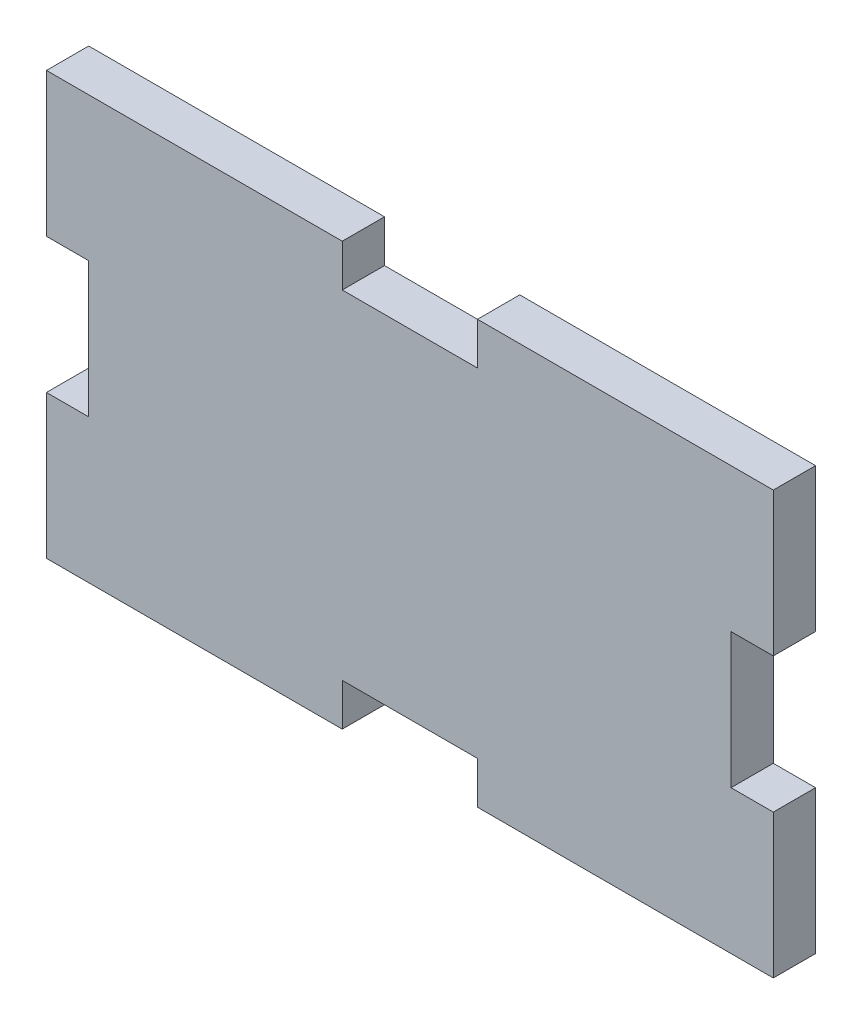
ISO-10303-21;
HEADER;
FILE_DESCRIPTION(('STEP AP214'),'2;1');
FILE_NAME('part.step','',(''),(''),'','','');
FILE_SCHEMA(('AUTOMOTIVE_DESIGN { 1 0 10303 214 1 1 1 1 }'));
ENDSEC;
DATA;
#1=APPLICATION_CONTEXT('core data for automotive mechanical design processes');
#2=APPLICATION_PROTOCOL_DEFINITION('international standard','automotive_design',2000,#1);
#3=PRODUCT_CONTEXT('',#1,'mechanical');
#4=PRODUCT('Part','Part','',(#3));
#5=PRODUCT_RELATED_PRODUCT_CATEGORY('part','',(#4));
#6=PRODUCT_DEFINITION_FORMATION('','',#4);
#7=PRODUCT_DEFINITION_CONTEXT('part definition',#1,'design');
#8=PRODUCT_DEFINITION('design','',#6,#7);
#9=PRODUCT_DEFINITION_SHAPE('','',#8);
#10=(LENGTH_UNIT() NAMED_UNIT(*) SI_UNIT(.MILLI.,.METRE.));
#11=(NAMED_UNIT(*) PLANE_ANGLE_UNIT() SI_UNIT($,.RADIAN.));
#12=(NAMED_UNIT(*) SI_UNIT($,.STERADIAN.) SOLID_ANGLE_UNIT());
#13=UNCERTAINTY_MEASURE_WITH_UNIT(LENGTH_MEASURE(1.E-05),#10,'distance_accuracy_value','');
#14=(GEOMETRIC_REPRESENTATION_CONTEXT(3) GLOBAL_UNCERTAINTY_ASSIGNED_CONTEXT((#13)) GLOBAL_UNIT_ASSIGNED_CONTEXT((#10,
#11,#12)) REPRESENTATION_CONTEXT('',''));
#15=CARTESIAN_POINT('',(0.,0.,0.));
#16=DIRECTION('',(0.,0.,1.));
#17=DIRECTION('',(1.,0.,0.));
#18=AXIS2_PLACEMENT_3D('',#15,#16,#17);
#19=CARTESIAN_POINT('',(8.,-25.,5.));
#20=DIRECTION('',(0.,1.,0.));
#21=DIRECTION('',(0.,0.,1.));
#22=AXIS2_PLACEMENT_3D('',#19,#20,#21);
#23=PLANE('',#22);
#24=DIRECTION('',(1.,0.,0.));
#25=VECTOR('',#24,1.);
#26=CARTESIAN_POINT('',(8.,-25.,0.));
#27=LINE('',#26,#25);
#28=CARTESIAN_POINT('',(8.,-25.,0.));
#29=VERTEX_POINT('',#28);
#30=CARTESIAN_POINT('',(43.,-25.,0.));
#31=VERTEX_POINT('',#30);
#32=EDGE_CURVE('E214',#29,#31,#27,.T.);
#33=ORIENTED_EDGE('',*,*,#32,.T.);
#34=DIRECTION('',(0.,0.,-1.));
#35=VECTOR('',#34,1.);
#36=CARTESIAN_POINT('',(43.,-25.,5.));
#37=LINE('',#36,#35);
#38=CARTESIAN_POINT('',(43.,-25.,5.));
#39=VERTEX_POINT('',#38);
#40=EDGE_CURVE('E11',#39,#31,#37,.T.);
#41=ORIENTED_EDGE('',*,*,#40,.F.);
#42=DIRECTION('',(1.,0.,0.));
#43=VECTOR('',#42,1.);
#44=CARTESIAN_POINT('',(8.,-25.,5.));
#45=LINE('',#44,#43);
#46=CARTESIAN_POINT('',(8.,-25.,5.));
#47=VERTEX_POINT('',#46);
#48=EDGE_CURVE('E272',#47,#39,#45,.T.);
#49=ORIENTED_EDGE('',*,*,#48,.F.);
#50=DIRECTION('',(0.,0.,-1.));
#51=VECTOR('',#50,1.);
#52=CARTESIAN_POINT('',(8.,-25.,5.));
#53=LINE('',#52,#51);
#54=EDGE_CURVE('E210',#47,#29,#53,.T.);
#55=ORIENTED_EDGE('',*,*,#54,.T.);
#56=EDGE_LOOP('',(#33,#41,#49,#55));
#57=FACE_BOUND('',#56,.T.);
#58=ADVANCED_FACE('F41',(#57),#23,.F.);
#59=CARTESIAN_POINT('',(43.,-8.,5.));
#60=DIRECTION('',(-1.,0.,0.));
#61=DIRECTION('',(0.,0.,1.));
#62=AXIS2_PLACEMENT_3D('',#59,#60,#61);
#63=PLANE('',#62);
#64=DIRECTION('',(0.,1.,0.));
#65=VECTOR('',#64,1.);
#66=CARTESIAN_POINT('',(43.,-8.,0.));
#67=LINE('',#66,#65);
#68=CARTESIAN_POINT('',(43.,-8.,0.));
#69=VERTEX_POINT('',#68);
#70=EDGE_CURVE('E218',#31,#69,#67,.T.);
#71=ORIENTED_EDGE('',*,*,#70,.T.);
#72=DIRECTION('',(0.,0.,-1.));
#73=VECTOR('',#72,1.);
#74=CARTESIAN_POINT('',(43.,-8.,5.));
#75=LINE('',#74,#73);
#76=CARTESIAN_POINT('',(43.,-8.,5.));
#77=VERTEX_POINT('',#76);
#78=EDGE_CURVE('E50',#77,#69,#75,.T.);
#79=ORIENTED_EDGE('',*,*,#78,.F.);
#80=DIRECTION('',(0.,1.,0.));
#81=VECTOR('',#80,1.);
#82=CARTESIAN_POINT('',(43.,-8.,5.));
#83=LINE('',#82,#81);
#84=EDGE_CURVE('E137',#39,#77,#83,.T.);
#85=ORIENTED_EDGE('',*,*,#84,.F.);
#86=ORIENTED_EDGE('',*,*,#40,.T.);
#87=EDGE_LOOP('',(#71,#79,#85,#86));
#88=FACE_BOUND('',#87,.T.);
#89=ADVANCED_FACE('F422',(#88),#63,.F.);
#90=CARTESIAN_POINT('',(38.,-8.,5.));
#91=DIRECTION('',(0.,-1.,0.));
#92=DIRECTION('',(1.,0.,0.));
#93=AXIS2_PLACEMENT_3D('',#90,#91,#92);
#94=PLANE('',#93);
#95=DIRECTION('',(-1.,0.,0.));
#96=VECTOR('',#95,1.);
#97=CARTESIAN_POINT('',(38.,-8.,0.));
#98=LINE('',#97,#96);
#99=CARTESIAN_POINT('',(38.,-8.,0.));
#100=VERTEX_POINT('',#99);
#101=EDGE_CURVE('E221',#69,#100,#98,.T.);
#102=ORIENTED_EDGE('',*,*,#101,.T.);
#103=DIRECTION('',(0.,0.,-1.));
#104=VECTOR('',#103,1.);
#105=CARTESIAN_POINT('',(38.,-8.,5.));
#106=LINE('',#105,#104);
#107=CARTESIAN_POINT('',(38.,-8.,5.));
#108=VERTEX_POINT('',#107);
#109=EDGE_CURVE('E331',#108,#100,#106,.T.);
#110=ORIENTED_EDGE('',*,*,#109,.F.);
#111=DIRECTION('',(-1.,0.,0.));
#112=VECTOR('',#111,1.);
#113=CARTESIAN_POINT('',(38.,-8.,5.));
#114=LINE('',#113,#112);
#115=EDGE_CURVE('E341',#77,#108,#114,.T.);
#116=ORIENTED_EDGE('',*,*,#115,.F.);
#117=ORIENTED_EDGE('',*,*,#78,.T.);
#118=EDGE_LOOP('',(#102,#110,#116,#117));
#119=FACE_BOUND('',#118,.T.);
#120=ADVANCED_FACE('F339',(#119),#94,.F.);
#121=CARTESIAN_POINT('',(38.,8.,5.));
#122=DIRECTION('',(-1.,0.,0.));
#123=DIRECTION('',(0.,0.,1.));
#124=AXIS2_PLACEMENT_3D('',#121,#122,#123);
#125=PLANE('',#124);
#126=DIRECTION('',(0.,1.,0.));
#127=VECTOR('',#126,1.);
#128=CARTESIAN_POINT('',(38.,8.,0.));
#129=LINE('',#128,#127);
#130=CARTESIAN_POINT('',(38.,8.,0.));
#131=VERTEX_POINT('',#130);
#132=EDGE_CURVE('E224',#100,#131,#129,.T.);
#133=ORIENTED_EDGE('',*,*,#132,.T.);
#134=DIRECTION('',(0.,0.,-1.));
#135=VECTOR('',#134,1.);
#136=CARTESIAN_POINT('',(38.,8.,5.));
#137=LINE('',#136,#135);
#138=CARTESIAN_POINT('',(38.,8.,5.));
#139=VERTEX_POINT('',#138);
#140=EDGE_CURVE('E327',#139,#131,#137,.T.);
#141=ORIENTED_EDGE('',*,*,#140,.F.);
#142=DIRECTION('',(0.,1.,0.));
#143=VECTOR('',#142,1.);
#144=CARTESIAN_POINT('',(38.,8.,5.));
#145=LINE('',#144,#143);
#146=EDGE_CURVE('E360',#108,#139,#145,.T.);
#147=ORIENTED_EDGE('',*,*,#146,.F.);
#148=ORIENTED_EDGE('',*,*,#109,.T.);
#149=EDGE_LOOP('',(#133,#141,#147,#148));
#150=FACE_BOUND('',#149,.T.);
#151=ADVANCED_FACE('F350',(#150),#125,.F.);
#152=CARTESIAN_POINT('',(43.,8.,5.));
#153=DIRECTION('',(0.,1.,0.));
#154=DIRECTION('',(-1.,0.,0.));
#155=AXIS2_PLACEMENT_3D('',#152,#153,#154);
#156=PLANE('',#155);
#157=DIRECTION('',(1.,0.,0.));
#158=VECTOR('',#157,1.);
#159=CARTESIAN_POINT('',(43.,8.,0.));
#160=LINE('',#159,#158);
#161=CARTESIAN_POINT('',(43.,8.,0.));
#162=VERTEX_POINT('',#161);
#163=EDGE_CURVE('E227',#131,#162,#160,.T.);
#164=ORIENTED_EDGE('',*,*,#163,.T.);
#165=DIRECTION('',(0.,0.,-1.));
#166=VECTOR('',#165,1.);
#167=CARTESIAN_POINT('',(43.,8.,5.));
#168=LINE('',#167,#166);
#169=CARTESIAN_POINT('',(43.,8.,5.));
#170=VERTEX_POINT('',#169);
#171=EDGE_CURVE('E323',#170,#162,#168,.T.);
#172=ORIENTED_EDGE('',*,*,#171,.F.);
#173=DIRECTION('',(1.,0.,0.));
#174=VECTOR('',#173,1.);
#175=CARTESIAN_POINT('',(43.,8.,5.));
#176=LINE('',#175,#174);
#177=EDGE_CURVE('E356',#139,#170,#176,.T.);
#178=ORIENTED_EDGE('',*,*,#177,.F.);
#179=ORIENTED_EDGE('',*,*,#140,.T.);
#180=EDGE_LOOP('',(#164,#172,#178,#179));
#181=FACE_BOUND('',#180,.T.);
#182=ADVANCED_FACE('F354',(#181),#156,.F.);
#183=CARTESIAN_POINT('',(43.,25.,5.));
#184=DIRECTION('',(-1.,0.,0.));
#185=DIRECTION('',(0.,-1.,0.));
#186=AXIS2_PLACEMENT_3D('',#183,#184,#185);
#187=PLANE('',#186);
#188=DIRECTION('',(0.,1.,0.));
#189=VECTOR('',#188,1.);
#190=CARTESIAN_POINT('',(43.,25.,0.));
#191=LINE('',#190,#189);
#192=CARTESIAN_POINT('',(43.,25.,0.));
#193=VERTEX_POINT('',#192);
#194=EDGE_CURVE('E230',#162,#193,#191,.T.);
#195=ORIENTED_EDGE('',*,*,#194,.T.);
#196=DIRECTION('',(0.,0.,-1.));
#197=VECTOR('',#196,1.);
#198=CARTESIAN_POINT('',(43.,25.,5.));
#199=LINE('',#198,#197);
#200=CARTESIAN_POINT('',(43.,25.,5.));
#201=VERTEX_POINT('',#200);
#202=EDGE_CURVE('E319',#201,#193,#199,.T.);
#203=ORIENTED_EDGE('',*,*,#202,.F.);
#204=DIRECTION('',(0.,1.,0.));
#205=VECTOR('',#204,1.);
#206=CARTESIAN_POINT('',(43.,25.,5.));
#207=LINE('',#206,#205);
#208=EDGE_CURVE('E359',#170,#201,#207,.T.);
#209=ORIENTED_EDGE('',*,*,#208,.F.);
#210=ORIENTED_EDGE('',*,*,#171,.T.);
#211=EDGE_LOOP('',(#195,#203,#209,#210));
#212=FACE_BOUND('',#211,.T.);
#213=ADVANCED_FACE('F435',(#212),#187,.F.);
#214=CARTESIAN_POINT('',(7.99999999999999,25.,5.));
#215=DIRECTION('',(0.,-1.,0.));
#216=DIRECTION('',(0.,0.,-1.));
#217=AXIS2_PLACEMENT_3D('',#214,#215,#216);
#218=PLANE('',#217);
#219=DIRECTION('',(-1.,0.,0.));
#220=VECTOR('',#219,1.);
#221=CARTESIAN_POINT('',(7.99999999999999,25.,0.));
#222=LINE('',#221,#220);
#223=CARTESIAN_POINT('',(7.99999999999999,25.,0.));
#224=VERTEX_POINT('',#223);
#225=EDGE_CURVE('E233',#193,#224,#222,.T.);
#226=ORIENTED_EDGE('',*,*,#225,.T.);
#227=DIRECTION('',(0.,0.,-1.));
#228=VECTOR('',#227,1.);
#229=CARTESIAN_POINT('',(7.99999999999999,25.,5.));
#230=LINE('',#229,#228);
#231=CARTESIAN_POINT('',(7.99999999999999,25.,5.));
#232=VERTEX_POINT('',#231);
#233=EDGE_CURVE('E315',#232,#224,#230,.T.);
#234=ORIENTED_EDGE('',*,*,#233,.F.);
#235=DIRECTION('',(-1.,0.,0.));
#236=VECTOR('',#235,1.);
#237=CARTESIAN_POINT('',(7.99999999999999,25.,5.));
#238=LINE('',#237,#236);
#239=EDGE_CURVE('E364',#201,#232,#238,.T.);
#240=ORIENTED_EDGE('',*,*,#239,.F.);
#241=ORIENTED_EDGE('',*,*,#202,.T.);
#242=EDGE_LOOP('',(#226,#234,#240,#241));
#243=FACE_BOUND('',#242,.T.);
#244=ADVANCED_FACE('F438',(#243),#218,.F.);
#245=CARTESIAN_POINT('',(7.99999999999999,20.,5.));
#246=DIRECTION('',(1.,0.,0.));
#247=DIRECTION('',(0.,0.,-1.));
#248=AXIS2_PLACEMENT_3D('',#245,#246,#247);
#249=PLANE('',#248);
#250=DIRECTION('',(0.,-1.,0.));
#251=VECTOR('',#250,1.);
#252=CARTESIAN_POINT('',(7.99999999999999,20.,0.));
#253=LINE('',#252,#251);
#254=CARTESIAN_POINT('',(7.99999999999999,20.,0.));
#255=VERTEX_POINT('',#254);
#256=EDGE_CURVE('E236',#224,#255,#253,.T.);
#257=ORIENTED_EDGE('',*,*,#256,.T.);
#258=DIRECTION('',(0.,0.,-1.));
#259=VECTOR('',#258,1.);
#260=CARTESIAN_POINT('',(7.99999999999999,20.,5.));
#261=LINE('',#260,#259);
#262=CARTESIAN_POINT('',(7.99999999999999,20.,5.));
#263=VERTEX_POINT('',#262);
#264=EDGE_CURVE('E311',#263,#255,#261,.T.);
#265=ORIENTED_EDGE('',*,*,#264,.F.);
#266=DIRECTION('',(0.,-1.,0.));
#267=VECTOR('',#266,1.);
#268=CARTESIAN_POINT('',(7.99999999999999,20.,5.));
#269=LINE('',#268,#267);
#270=EDGE_CURVE('E371',#232,#263,#269,.T.);
#271=ORIENTED_EDGE('',*,*,#270,.F.);
#272=ORIENTED_EDGE('',*,*,#233,.T.);
#273=EDGE_LOOP('',(#257,#265,#271,#272));
#274=FACE_BOUND('',#273,.T.);
#275=ADVANCED_FACE('F442',(#274),#249,.F.);
#276=CARTESIAN_POINT('',(-8.00000000000001,20.,5.));
#277=DIRECTION('',(0.,-1.,0.));
#278=DIRECTION('',(0.,0.,-1.));
#279=AXIS2_PLACEMENT_3D('',#276,#277,#278);
#280=PLANE('',#279);
#281=DIRECTION('',(-1.,0.,0.));
#282=VECTOR('',#281,1.);
#283=CARTESIAN_POINT('',(-8.00000000000001,20.,0.));
#284=LINE('',#283,#282);
#285=CARTESIAN_POINT('',(-8.00000000000001,20.,0.));
#286=VERTEX_POINT('',#285);
#287=EDGE_CURVE('E239',#255,#286,#284,.T.);
#288=ORIENTED_EDGE('',*,*,#287,.T.);
#289=DIRECTION('',(0.,0.,-1.));
#290=VECTOR('',#289,1.);
#291=CARTESIAN_POINT('',(-8.00000000000001,20.,5.));
#292=LINE('',#291,#290);
#293=CARTESIAN_POINT('',(-8.00000000000001,20.,5.));
#294=VERTEX_POINT('',#293);
#295=EDGE_CURVE('E307',#294,#286,#292,.T.);
#296=ORIENTED_EDGE('',*,*,#295,.F.);
#297=DIRECTION('',(-1.,0.,0.));
#298=VECTOR('',#297,1.);
#299=CARTESIAN_POINT('',(-8.00000000000001,20.,5.));
#300=LINE('',#299,#298);
#301=EDGE_CURVE('E374',#263,#294,#300,.T.);
#302=ORIENTED_EDGE('',*,*,#301,.F.);
#303=ORIENTED_EDGE('',*,*,#264,.T.);
#304=EDGE_LOOP('',(#288,#296,#302,#303));
#305=FACE_BOUND('',#304,.T.);
#306=ADVANCED_FACE('F446',(#305),#280,.F.);
#307=CARTESIAN_POINT('',(-7.99999999999999,25.,5.));
#308=DIRECTION('',(-1.,0.,0.));
#309=DIRECTION('',(0.,-1.,0.));
#310=AXIS2_PLACEMENT_3D('',#307,#308,#309);
#311=PLANE('',#310);
#312=DIRECTION('',(0.,1.,0.));
#313=VECTOR('',#312,1.);
#314=CARTESIAN_POINT('',(-7.99999999999999,25.,0.));
#315=LINE('',#314,#313);
#316=CARTESIAN_POINT('',(-7.99999999999999,25.,0.));
#317=VERTEX_POINT('',#316);
#318=EDGE_CURVE('E242',#286,#317,#315,.T.);
#319=ORIENTED_EDGE('',*,*,#318,.T.);
#320=DIRECTION('',(0.,0.,-1.));
#321=VECTOR('',#320,1.);
#322=CARTESIAN_POINT('',(-7.99999999999999,25.,5.));
#323=LINE('',#322,#321);
#324=CARTESIAN_POINT('',(-7.99999999999999,25.,5.));
#325=VERTEX_POINT('',#324);
#326=EDGE_CURVE('E303',#325,#317,#323,.T.);
#327=ORIENTED_EDGE('',*,*,#326,.F.);
#328=DIRECTION('',(0.,1.,0.));
#329=VECTOR('',#328,1.);
#330=CARTESIAN_POINT('',(-7.99999999999999,25.,5.));
#331=LINE('',#330,#329);
#332=EDGE_CURVE('E377',#294,#325,#331,.T.);
#333=ORIENTED_EDGE('',*,*,#332,.F.);
#334=ORIENTED_EDGE('',*,*,#295,.T.);
#335=EDGE_LOOP('',(#319,#327,#333,#334));
#336=FACE_BOUND('',#335,.T.);
#337=ADVANCED_FACE('F450',(#336),#311,.F.);
#338=CARTESIAN_POINT('',(-43.,25.,5.));
#339=DIRECTION('',(0.,-1.,0.));
#340=DIRECTION('',(1.,0.,0.));
#341=AXIS2_PLACEMENT_3D('',#338,#339,#340);
#342=PLANE('',#341);
#343=DIRECTION('',(-1.,0.,0.));
#344=VECTOR('',#343,1.);
#345=CARTESIAN_POINT('',(-43.,25.,0.));
#346=LINE('',#345,#344);
#347=CARTESIAN_POINT('',(-43.,25.,0.));
#348=VERTEX_POINT('',#347);
#349=EDGE_CURVE('E245',#317,#348,#346,.T.);
#350=ORIENTED_EDGE('',*,*,#349,.T.);
#351=DIRECTION('',(0.,0.,-1.));
#352=VECTOR('',#351,1.);
#353=CARTESIAN_POINT('',(-43.,25.,5.));
#354=LINE('',#353,#352);
#355=CARTESIAN_POINT('',(-43.,25.,5.));
#356=VERTEX_POINT('',#355);
#357=EDGE_CURVE('E299',#356,#348,#354,.T.);
#358=ORIENTED_EDGE('',*,*,#357,.F.);
#359=DIRECTION('',(-1.,0.,0.));
#360=VECTOR('',#359,1.);
#361=CARTESIAN_POINT('',(-43.,25.,5.));
#362=LINE('',#361,#360);
#363=EDGE_CURVE('E380',#325,#356,#362,.T.);
#364=ORIENTED_EDGE('',*,*,#363,.F.);
#365=ORIENTED_EDGE('',*,*,#326,.T.);
#366=EDGE_LOOP('',(#350,#358,#364,#365));
#367=FACE_BOUND('',#366,.T.);
#368=ADVANCED_FACE('F454',(#367),#342,.F.);
#369=CARTESIAN_POINT('',(-43.,25.,5.));
#370=DIRECTION('',(1.,0.,0.));
#371=DIRECTION('',(0.,1.,0.));
#372=AXIS2_PLACEMENT_3D('',#369,#370,#371);
#373=PLANE('',#372);
#374=DIRECTION('',(0.,-1.,0.));
#375=VECTOR('',#374,1.);
#376=CARTESIAN_POINT('',(-43.,25.,0.));
#377=LINE('',#376,#375);
#378=CARTESIAN_POINT('',(-43.,8.,0.));
#379=VERTEX_POINT('',#378);
#380=EDGE_CURVE('E248',#348,#379,#377,.T.);
#381=ORIENTED_EDGE('',*,*,#380,.T.);
#382=DIRECTION('',(0.,0.,-1.));
#383=VECTOR('',#382,1.);
#384=CARTESIAN_POINT('',(-43.,8.,5.));
#385=LINE('',#384,#383);
#386=CARTESIAN_POINT('',(-43.,8.,5.));
#387=VERTEX_POINT('',#386);
#388=EDGE_CURVE('E295',#387,#379,#385,.T.);
#389=ORIENTED_EDGE('',*,*,#388,.F.);
#390=DIRECTION('',(0.,-1.,0.));
#391=VECTOR('',#390,1.);
#392=CARTESIAN_POINT('',(-43.,25.,5.));
#393=LINE('',#392,#391);
#394=EDGE_CURVE('E383',#356,#387,#393,.T.);
#395=ORIENTED_EDGE('',*,*,#394,.F.);
#396=ORIENTED_EDGE('',*,*,#357,.T.);
#397=EDGE_LOOP('',(#381,#389,#395,#396));
#398=FACE_BOUND('',#397,.T.);
#399=ADVANCED_FACE('F458',(#398),#373,.F.);
#400=CARTESIAN_POINT('',(-43.,8.,5.));
#401=DIRECTION('',(0.,1.,0.));
#402=DIRECTION('',(0.,0.,1.));
#403=AXIS2_PLACEMENT_3D('',#400,#401,#402);
#404=PLANE('',#403);
#405=DIRECTION('',(1.,0.,0.));
#406=VECTOR('',#405,1.);
#407=CARTESIAN_POINT('',(-43.,8.,0.));
#408=LINE('',#407,#406);
#409=CARTESIAN_POINT('',(-38.,8.,0.));
#410=VERTEX_POINT('',#409);
#411=EDGE_CURVE('E251',#379,#410,#408,.T.);
#412=ORIENTED_EDGE('',*,*,#411,.T.);
#413=DIRECTION('',(0.,0.,-1.));
#414=VECTOR('',#413,1.);
#415=CARTESIAN_POINT('',(-38.,8.,5.));
#416=LINE('',#415,#414);
#417=CARTESIAN_POINT('',(-38.,8.,5.));
#418=VERTEX_POINT('',#417);
#419=EDGE_CURVE('E291',#418,#410,#416,.T.);
#420=ORIENTED_EDGE('',*,*,#419,.F.);
#421=DIRECTION('',(1.,0.,0.));
#422=VECTOR('',#421,1.);
#423=CARTESIAN_POINT('',(-43.,8.,5.));
#424=LINE('',#423,#422);
#425=EDGE_CURVE('E386',#387,#418,#424,.T.);
#426=ORIENTED_EDGE('',*,*,#425,.F.);
#427=ORIENTED_EDGE('',*,*,#388,.T.);
#428=EDGE_LOOP('',(#412,#420,#426,#427));
#429=FACE_BOUND('',#428,.T.);
#430=ADVANCED_FACE('F462',(#429),#404,.F.);
#431=CARTESIAN_POINT('',(-38.,8.,5.));
#432=DIRECTION('',(1.,0.,0.));
#433=DIRECTION('',(0.,0.,-1.));
#434=AXIS2_PLACEMENT_3D('',#431,#432,#433);
#435=PLANE('',#434);
#436=DIRECTION('',(0.,-1.,0.));
#437=VECTOR('',#436,1.);
#438=CARTESIAN_POINT('',(-38.,8.,0.));
#439=LINE('',#438,#437);
#440=CARTESIAN_POINT('',(-38.,-8.,0.));
#441=VERTEX_POINT('',#440);
#442=EDGE_CURVE('E254',#410,#441,#439,.T.);
#443=ORIENTED_EDGE('',*,*,#442,.T.);
#444=DIRECTION('',(0.,0.,-1.));
#445=VECTOR('',#444,1.);
#446=CARTESIAN_POINT('',(-38.,-8.,5.));
#447=LINE('',#446,#445);
#448=CARTESIAN_POINT('',(-38.,-8.,5.));
#449=VERTEX_POINT('',#448);
#450=EDGE_CURVE('E287',#449,#441,#447,.T.);
#451=ORIENTED_EDGE('',*,*,#450,.F.);
#452=DIRECTION('',(0.,-1.,0.));
#453=VECTOR('',#452,1.);
#454=CARTESIAN_POINT('',(-38.,8.,5.));
#455=LINE('',#454,#453);
#456=EDGE_CURVE('E389',#418,#449,#455,.T.);
#457=ORIENTED_EDGE('',*,*,#456,.F.);
#458=ORIENTED_EDGE('',*,*,#419,.T.);
#459=EDGE_LOOP('',(#443,#451,#457,#458));
#460=FACE_BOUND('',#459,.T.);
#461=ADVANCED_FACE('F466',(#460),#435,.F.);
#462=CARTESIAN_POINT('',(-38.,-8.,5.));
#463=DIRECTION('',(0.,-1.,0.));
#464=DIRECTION('',(0.,0.,-1.));
#465=AXIS2_PLACEMENT_3D('',#462,#463,#464);
#466=PLANE('',#465);
#467=DIRECTION('',(-1.,0.,0.));
#468=VECTOR('',#467,1.);
#469=CARTESIAN_POINT('',(-38.,-8.,0.));
#470=LINE('',#469,#468);
#471=CARTESIAN_POINT('',(-43.,-8.,0.));
#472=VERTEX_POINT('',#471);
#473=EDGE_CURVE('E257',#441,#472,#470,.T.);
#474=ORIENTED_EDGE('',*,*,#473,.T.);
#475=DIRECTION('',(0.,0.,-1.));
#476=VECTOR('',#475,1.);
#477=CARTESIAN_POINT('',(-43.,-8.,5.));
#478=LINE('',#477,#476);
#479=CARTESIAN_POINT('',(-43.,-8.,5.));
#480=VERTEX_POINT('',#479);
#481=EDGE_CURVE('E283',#480,#472,#478,.T.);
#482=ORIENTED_EDGE('',*,*,#481,.F.);
#483=DIRECTION('',(-1.,0.,0.));
#484=VECTOR('',#483,1.);
#485=CARTESIAN_POINT('',(-38.,-8.,5.));
#486=LINE('',#485,#484);
#487=EDGE_CURVE('E392',#449,#480,#486,.T.);
#488=ORIENTED_EDGE('',*,*,#487,.F.);
#489=ORIENTED_EDGE('',*,*,#450,.T.);
#490=EDGE_LOOP('',(#474,#482,#488,#489));
#491=FACE_BOUND('',#490,.T.);
#492=ADVANCED_FACE('F470',(#491),#466,.F.);
#493=CARTESIAN_POINT('',(-43.,-8.,5.));
#494=DIRECTION('',(1.,0.,0.));
#495=DIRECTION('',(0.,1.,0.));
#496=AXIS2_PLACEMENT_3D('',#493,#494,#495);
#497=PLANE('',#496);
#498=DIRECTION('',(0.,-1.,0.));
#499=VECTOR('',#498,1.);
#500=CARTESIAN_POINT('',(-43.,-8.,0.));
#501=LINE('',#500,#499);
#502=CARTESIAN_POINT('',(-43.,-25.,0.));
#503=VERTEX_POINT('',#502);
#504=EDGE_CURVE('E260',#472,#503,#501,.T.);
#505=ORIENTED_EDGE('',*,*,#504,.T.);
#506=DIRECTION('',(0.,0.,-1.));
#507=VECTOR('',#506,1.);
#508=CARTESIAN_POINT('',(-43.,-25.,5.));
#509=LINE('',#508,#507);
#510=CARTESIAN_POINT('',(-43.,-25.,5.));
#511=VERTEX_POINT('',#510);
#512=EDGE_CURVE('E279',#511,#503,#509,.T.);
#513=ORIENTED_EDGE('',*,*,#512,.F.);
#514=DIRECTION('',(0.,-1.,0.));
#515=VECTOR('',#514,1.);
#516=CARTESIAN_POINT('',(-43.,-8.,5.));
#517=LINE('',#516,#515);
#518=EDGE_CURVE('E395',#480,#511,#517,.T.);
#519=ORIENTED_EDGE('',*,*,#518,.F.);
#520=ORIENTED_EDGE('',*,*,#481,.T.);
#521=EDGE_LOOP('',(#505,#513,#519,#520));
#522=FACE_BOUND('',#521,.T.);
#523=ADVANCED_FACE('F403',(#522),#497,.F.);
#524=CARTESIAN_POINT('',(-43.,-25.,5.));
#525=DIRECTION('',(0.,1.,0.));
#526=DIRECTION('',(-1.,0.,0.));
#527=AXIS2_PLACEMENT_3D('',#524,#525,#526);
#528=PLANE('',#527);
#529=DIRECTION('',(1.,0.,0.));
#530=VECTOR('',#529,1.);
#531=CARTESIAN_POINT('',(-43.,-25.,0.));
#532=LINE('',#531,#530);
#533=CARTESIAN_POINT('',(-8.,-25.,0.));
#534=VERTEX_POINT('',#533);
#535=EDGE_CURVE('E263',#503,#534,#532,.T.);
#536=ORIENTED_EDGE('',*,*,#535,.T.);
#537=DIRECTION('',(0.,0.,-1.));
#538=VECTOR('',#537,1.);
#539=CARTESIAN_POINT('',(-8.,-25.,5.));
#540=LINE('',#539,#538);
#541=CARTESIAN_POINT('',(-8.,-25.,5.));
#542=VERTEX_POINT('',#541);
#543=EDGE_CURVE('E203',#542,#534,#540,.T.);
#544=ORIENTED_EDGE('',*,*,#543,.F.);
#545=DIRECTION('',(1.,0.,0.));
#546=VECTOR('',#545,1.);
#547=CARTESIAN_POINT('',(-43.,-25.,5.));
#548=LINE('',#547,#546);
#549=EDGE_CURVE('E192',#511,#542,#548,.T.);
#550=ORIENTED_EDGE('',*,*,#549,.F.);
#551=ORIENTED_EDGE('',*,*,#512,.T.);
#552=EDGE_LOOP('',(#536,#544,#550,#551));
#553=FACE_BOUND('',#552,.T.);
#554=ADVANCED_FACE('F407',(#553),#528,.F.);
#555=CARTESIAN_POINT('',(-8.,-25.,5.));
#556=DIRECTION('',(-1.,0.,0.));
#557=DIRECTION('',(0.,-1.,0.));
#558=AXIS2_PLACEMENT_3D('',#555,#556,#557);
#559=PLANE('',#558);
#560=DIRECTION('',(0.,1.,0.));
#561=VECTOR('',#560,1.);
#562=CARTESIAN_POINT('',(-8.,-25.,0.));
#563=LINE('',#562,#561);
#564=CARTESIAN_POINT('',(-8.,-20.,0.));
#565=VERTEX_POINT('',#564);
#566=EDGE_CURVE('E201',#534,#565,#563,.T.);
#567=ORIENTED_EDGE('',*,*,#566,.T.);
#568=DIRECTION('',(0.,0.,-1.));
#569=VECTOR('',#568,1.);
#570=CARTESIAN_POINT('',(-8.,-20.,5.));
#571=LINE('',#570,#569);
#572=CARTESIAN_POINT('',(-8.,-20.,5.));
#573=VERTEX_POINT('',#572);
#574=EDGE_CURVE('E198',#573,#565,#571,.T.);
#575=ORIENTED_EDGE('',*,*,#574,.F.);
#576=DIRECTION('',(0.,1.,0.));
#577=VECTOR('',#576,1.);
#578=CARTESIAN_POINT('',(-8.,-25.,5.));
#579=LINE('',#578,#577);
#580=EDGE_CURVE('E186',#542,#573,#579,.T.);
#581=ORIENTED_EDGE('',*,*,#580,.F.);
#582=ORIENTED_EDGE('',*,*,#543,.T.);
#583=EDGE_LOOP('',(#567,#575,#581,#582));
#584=FACE_BOUND('',#583,.T.);
#585=ADVANCED_FACE('F199',(#584),#559,.F.);
#586=CARTESIAN_POINT('',(-8.,-20.,5.));
#587=DIRECTION('',(0.,1.,0.));
#588=DIRECTION('',(0.,0.,1.));
#589=AXIS2_PLACEMENT_3D('',#586,#587,#588);
#590=PLANE('',#589);
#591=DIRECTION('',(1.,0.,0.));
#592=VECTOR('',#591,1.);
#593=CARTESIAN_POINT('',(-8.,-20.,0.));
#594=LINE('',#593,#592);
#595=CARTESIAN_POINT('',(8.,-20.,0.));
#596=VERTEX_POINT('',#595);
#597=EDGE_CURVE('E123',#565,#596,#594,.T.);
#598=ORIENTED_EDGE('',*,*,#597,.T.);
#599=DIRECTION('',(0.,0.,-1.));
#600=VECTOR('',#599,1.);
#601=CARTESIAN_POINT('',(8.,-20.,5.));
#602=LINE('',#601,#600);
#603=CARTESIAN_POINT('',(8.,-20.,5.));
#604=VERTEX_POINT('',#603);
#605=EDGE_CURVE('E204',#604,#596,#602,.T.);
#606=ORIENTED_EDGE('',*,*,#605,.F.);
#607=DIRECTION('',(1.,0.,0.));
#608=VECTOR('',#607,1.);
#609=CARTESIAN_POINT('',(-8.,-20.,5.));
#610=LINE('',#609,#608);
#611=EDGE_CURVE('E190',#573,#604,#610,.T.);
#612=ORIENTED_EDGE('',*,*,#611,.F.);
#613=ORIENTED_EDGE('',*,*,#574,.T.);
#614=EDGE_LOOP('',(#598,#606,#612,#613));
#615=FACE_BOUND('',#614,.T.);
#616=ADVANCED_FACE('F206',(#615),#590,.F.);
#617=CARTESIAN_POINT('',(8.,-20.,5.));
#618=DIRECTION('',(1.,0.,0.));
#619=DIRECTION('',(0.,0.,-1.));
#620=AXIS2_PLACEMENT_3D('',#617,#618,#619);
#621=PLANE('',#620);
#622=DIRECTION('',(0.,-1.,0.));
#623=VECTOR('',#622,1.);
#624=CARTESIAN_POINT('',(8.,-20.,0.));
#625=LINE('',#624,#623);
#626=EDGE_CURVE('E129',#596,#29,#625,.T.);
#627=ORIENTED_EDGE('',*,*,#626,.T.);
#628=ORIENTED_EDGE('',*,*,#54,.F.);
#629=DIRECTION('',(0.,-1.,0.));
#630=VECTOR('',#629,1.);
#631=CARTESIAN_POINT('',(8.,-20.,5.));
#632=LINE('',#631,#630);
#633=EDGE_CURVE('E58',#604,#47,#632,.T.);
#634=ORIENTED_EDGE('',*,*,#633,.F.);
#635=ORIENTED_EDGE('',*,*,#605,.T.);
#636=EDGE_LOOP('',(#627,#628,#634,#635));
#637=FACE_BOUND('',#636,.T.);
#638=ADVANCED_FACE('F411',(#637),#621,.F.);
#639=CARTESIAN_POINT('',(0.,0.,5.));
#640=DIRECTION('',(0.,0.,-1.));
#641=DIRECTION('',(-1.,0.,0.));
#642=AXIS2_PLACEMENT_3D('',#639,#640,#641);
#643=PLANE('',#642);
#644=ORIENTED_EDGE('',*,*,#48,.T.);
#645=ORIENTED_EDGE('',*,*,#84,.T.);
#646=ORIENTED_EDGE('',*,*,#115,.T.);
#647=ORIENTED_EDGE('',*,*,#146,.T.);
#648=ORIENTED_EDGE('',*,*,#177,.T.);
#649=ORIENTED_EDGE('',*,*,#208,.T.);
#650=ORIENTED_EDGE('',*,*,#239,.T.);
#651=ORIENTED_EDGE('',*,*,#270,.T.);
#652=ORIENTED_EDGE('',*,*,#301,.T.);
#653=ORIENTED_EDGE('',*,*,#332,.T.);
#654=ORIENTED_EDGE('',*,*,#363,.T.);
#655=ORIENTED_EDGE('',*,*,#394,.T.);
#656=ORIENTED_EDGE('',*,*,#425,.T.);
#657=ORIENTED_EDGE('',*,*,#456,.T.);
#658=ORIENTED_EDGE('',*,*,#487,.T.);
#659=ORIENTED_EDGE('',*,*,#518,.T.);
#660=ORIENTED_EDGE('',*,*,#549,.T.);
#661=ORIENTED_EDGE('',*,*,#580,.T.);
#662=ORIENTED_EDGE('',*,*,#611,.T.);
#663=ORIENTED_EDGE('',*,*,#633,.T.);
#664=EDGE_LOOP('',(#644,#645,#646,#647,#648,#649,#650,#651,#652,#653,#654,#655,#656,#657,#658,
#659,#660,#661,#662,#663));
#665=FACE_BOUND('',#664,.T.);
#666=ADVANCED_FACE('F188',(#665),#643,.F.);
#667=CARTESIAN_POINT('',(0.,0.,0.));
#668=DIRECTION('',(0.,0.,-1.));
#669=DIRECTION('',(-1.,0.,0.));
#670=AXIS2_PLACEMENT_3D('',#667,#668,#669);
#671=PLANE('',#670);
#672=ORIENTED_EDGE('',*,*,#32,.F.);
#673=ORIENTED_EDGE('',*,*,#626,.F.);
#674=ORIENTED_EDGE('',*,*,#597,.F.);
#675=ORIENTED_EDGE('',*,*,#566,.F.);
#676=ORIENTED_EDGE('',*,*,#535,.F.);
#677=ORIENTED_EDGE('',*,*,#504,.F.);
#678=ORIENTED_EDGE('',*,*,#473,.F.);
#679=ORIENTED_EDGE('',*,*,#442,.F.);
#680=ORIENTED_EDGE('',*,*,#411,.F.);
#681=ORIENTED_EDGE('',*,*,#380,.F.);
#682=ORIENTED_EDGE('',*,*,#349,.F.);
#683=ORIENTED_EDGE('',*,*,#318,.F.);
#684=ORIENTED_EDGE('',*,*,#287,.F.);
#685=ORIENTED_EDGE('',*,*,#256,.F.);
#686=ORIENTED_EDGE('',*,*,#225,.F.);
#687=ORIENTED_EDGE('',*,*,#194,.F.);
#688=ORIENTED_EDGE('',*,*,#163,.F.);
#689=ORIENTED_EDGE('',*,*,#132,.F.);
#690=ORIENTED_EDGE('',*,*,#101,.F.);
#691=ORIENTED_EDGE('',*,*,#70,.F.);
#692=EDGE_LOOP('',(#672,#673,#674,#675,#676,#677,#678,#679,#680,#681,#682,#683,#684,#685,#686,
#687,#688,#689,#690,#691));
#693=FACE_BOUND('',#692,.T.);
#694=ADVANCED_FACE('F345',(#693),#671,.T.);
#695=CLOSED_SHELL('',(#58,#89,#120,#151,#182,#213,#244,#275,#306,#337,#368,#399,#430,#461,#492,
#523,#554,#585,#616,#638,#666,#694));
#696=MANIFOLD_SOLID_BREP('B2',#695);
#697=ADVANCED_BREP_SHAPE_REPRESENTATION('',(#18,#696),#14);
#698=SHAPE_DEFINITION_REPRESENTATION(#9,#697);
ENDSEC;
END-ISO-10303-21;
